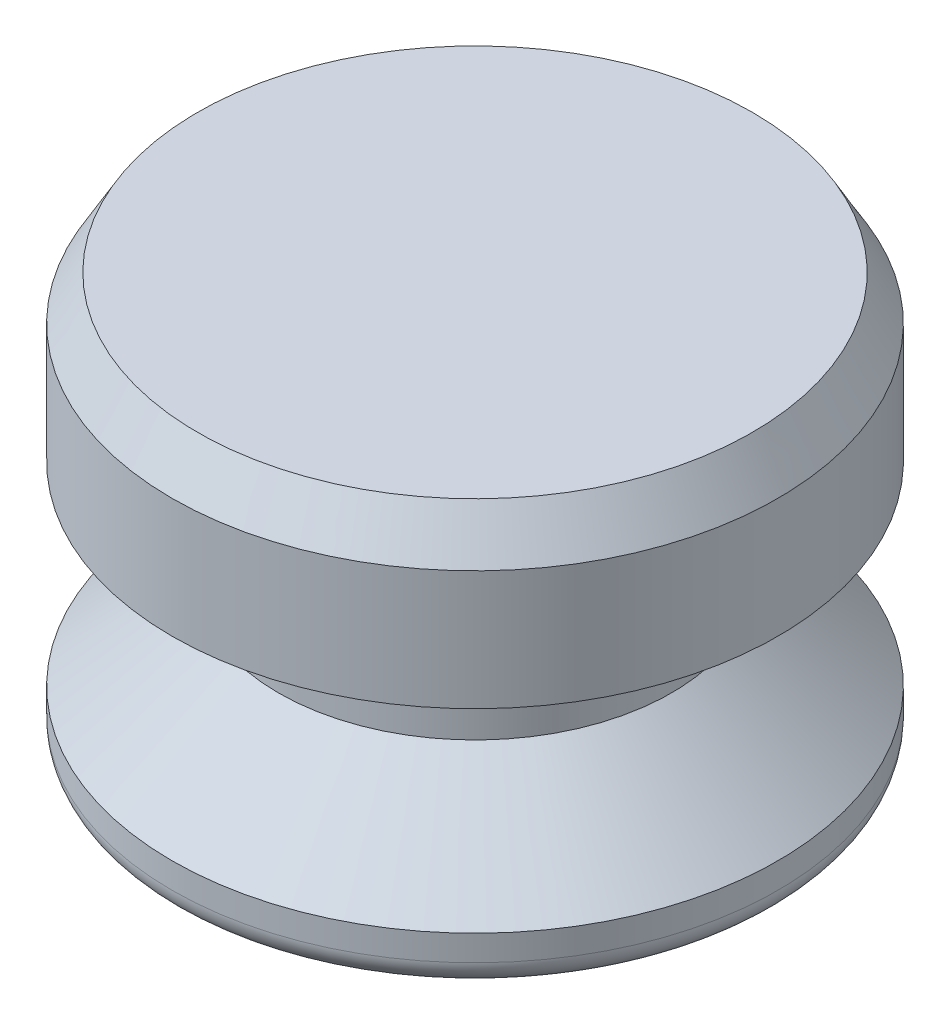
ISO-10303-21;
HEADER;
FILE_DESCRIPTION(('STEP AP214'),'2;1');
FILE_NAME('part.step','',(''),(''),'','','');
FILE_SCHEMA(('AUTOMOTIVE_DESIGN { 1 0 10303 214 1 1 1 1 }'));
ENDSEC;
DATA;
#1=APPLICATION_CONTEXT('core data for automotive mechanical design processes');
#2=APPLICATION_PROTOCOL_DEFINITION('international standard','automotive_design',2000,#1);
#3=PRODUCT_CONTEXT('',#1,'mechanical');
#4=PRODUCT('Part','Part','',(#3));
#5=PRODUCT_RELATED_PRODUCT_CATEGORY('part','',(#4));
#6=PRODUCT_DEFINITION_FORMATION('','',#4);
#7=PRODUCT_DEFINITION_CONTEXT('part definition',#1,'design');
#8=PRODUCT_DEFINITION('design','',#6,#7);
#9=PRODUCT_DEFINITION_SHAPE('','',#8);
#10=(LENGTH_UNIT() NAMED_UNIT(*) SI_UNIT(.MILLI.,.METRE.));
#11=(NAMED_UNIT(*) PLANE_ANGLE_UNIT() SI_UNIT($,.RADIAN.));
#12=(NAMED_UNIT(*) SI_UNIT($,.STERADIAN.) SOLID_ANGLE_UNIT());
#13=UNCERTAINTY_MEASURE_WITH_UNIT(LENGTH_MEASURE(1.E-05),#10,'distance_accuracy_value','');
#14=(GEOMETRIC_REPRESENTATION_CONTEXT(3) GLOBAL_UNCERTAINTY_ASSIGNED_CONTEXT((#13)) GLOBAL_UNIT_ASSIGNED_CONTEXT((#10,
#11,#12)) REPRESENTATION_CONTEXT('',''));
#15=CARTESIAN_POINT('',(0.,0.,0.));
#16=DIRECTION('',(0.,0.,1.));
#17=DIRECTION('',(1.,0.,0.));
#18=AXIS2_PLACEMENT_3D('',#15,#16,#17);
#19=CARTESIAN_POINT('',(0.,0.,0.));
#20=DIRECTION('',(0.,1.,0.));
#21=DIRECTION('',(0.,0.,1.));
#22=AXIS2_PLACEMENT_3D('',#19,#20,#21);
#23=PLANE('',#22);
#24=CARTESIAN_POINT('',(0.,0.,0.));
#25=DIRECTION('',(0.,1.,0.));
#26=DIRECTION('',(0.,0.,1.));
#27=AXIS2_PLACEMENT_3D('',#24,#25,#26);
#28=CIRCLE('',#27,8.60425);
#29=CARTESIAN_POINT('',(0.,0.,8.60425));
#30=VERTEX_POINT('',#29);
#31=EDGE_CURVE('E45',#30,#30,#28,.F.);
#32=ORIENTED_EDGE('',*,*,#31,.T.);
#33=EDGE_LOOP('',(#32));
#34=FACE_BOUND('',#33,.T.);
#35=ADVANCED_FACE('F30',(#34),#23,.F.);
#36=CARTESIAN_POINT('',(0.,0.,0.));
#37=DIRECTION('',(0.,-1.,0.));
#38=DIRECTION('',(0.,0.,-1.));
#39=AXIS2_PLACEMENT_3D('',#36,#37,#38);
#40=CYLINDRICAL_SURFACE('',#39,9.398);
#41=CARTESIAN_POINT('',(0.,0.793749999999999,0.));
#42=DIRECTION('',(0.,1.,0.));
#43=DIRECTION('',(0.,0.,1.));
#44=AXIS2_PLACEMENT_3D('',#41,#42,#43);
#45=CIRCLE('',#44,9.398);
#46=CARTESIAN_POINT('',(0.,0.793749999999999,9.398));
#47=VERTEX_POINT('',#46);
#48=EDGE_CURVE('E41',#47,#47,#45,.T.);
#49=ORIENTED_EDGE('',*,*,#48,.T.);
#50=EDGE_LOOP('',(#49));
#51=FACE_BOUND('',#50,.T.);
#52=CARTESIAN_POINT('',(0.,1.5875,0.));
#53=DIRECTION('',(0.,-1.,0.));
#54=DIRECTION('',(0.,0.,-1.));
#55=AXIS2_PLACEMENT_3D('',#52,#53,#54);
#56=CIRCLE('',#55,9.398);
#57=CARTESIAN_POINT('',(0.,1.5875,-9.398));
#58=VERTEX_POINT('',#57);
#59=EDGE_CURVE('E50',#58,#58,#56,.T.);
#60=ORIENTED_EDGE('',*,*,#59,.T.);
#61=EDGE_LOOP('',(#60));
#62=FACE_BOUND('',#61,.T.);
#63=ADVANCED_FACE('F79',(#51,#62),#40,.T.);
#64=CARTESIAN_POINT('',(0.,4.445,0.));
#65=DIRECTION('',(0.,-1.,0.));
#66=DIRECTION('',(0.,0.,-1.));
#67=AXIS2_PLACEMENT_3D('',#64,#65,#66);
#68=CONICAL_SURFACE('',#67,6.096,0.857438228784276);
#69=ORIENTED_EDGE('',*,*,#59,.F.);
#70=EDGE_LOOP('',(#69));
#71=FACE_BOUND('',#70,.T.);
#72=CARTESIAN_POINT('',(0.,4.445,0.));
#73=DIRECTION('',(0.,-1.,0.));
#74=DIRECTION('',(0.,0.,-1.));
#75=AXIS2_PLACEMENT_3D('',#72,#73,#74);
#76=CIRCLE('',#75,6.096);
#77=CARTESIAN_POINT('',(0.,4.445,-6.096));
#78=VERTEX_POINT('',#77);
#79=EDGE_CURVE('E53',#78,#78,#76,.T.);
#80=ORIENTED_EDGE('',*,*,#79,.T.);
#81=EDGE_LOOP('',(#80));
#82=FACE_BOUND('',#81,.T.);
#83=ADVANCED_FACE('F85',(#71,#82),#68,.T.);
#84=CARTESIAN_POINT('',(0.,0.,0.));
#85=DIRECTION('',(0.,-1.,0.));
#86=DIRECTION('',(0.,0.,-1.));
#87=AXIS2_PLACEMENT_3D('',#84,#85,#86);
#88=CYLINDRICAL_SURFACE('',#87,6.096);
#89=ORIENTED_EDGE('',*,*,#79,.F.);
#90=EDGE_LOOP('',(#89));
#91=FACE_BOUND('',#90,.T.);
#92=CARTESIAN_POINT('',(0.,7.62,0.));
#93=DIRECTION('',(0.,-1.,0.));
#94=DIRECTION('',(0.,0.,-1.));
#95=AXIS2_PLACEMENT_3D('',#92,#93,#94);
#96=CIRCLE('',#95,6.096);
#97=CARTESIAN_POINT('',(0.,7.62,-6.096));
#98=VERTEX_POINT('',#97);
#99=EDGE_CURVE('E56',#98,#98,#96,.T.);
#100=ORIENTED_EDGE('',*,*,#99,.T.);
#101=EDGE_LOOP('',(#100));
#102=FACE_BOUND('',#101,.T.);
#103=ADVANCED_FACE('F75',(#91,#102),#88,.T.);
#104=CARTESIAN_POINT('',(-6.096,7.62,0.));
#105=DIRECTION('',(0.,1.,0.));
#106=DIRECTION('',(0.,0.,1.));
#107=AXIS2_PLACEMENT_3D('',#104,#105,#106);
#108=PLANE('',#107);
#109=ORIENTED_EDGE('',*,*,#99,.F.);
#110=EDGE_LOOP('',(#109));
#111=FACE_BOUND('',#110,.T.);
#112=CARTESIAN_POINT('',(0.,7.62,0.));
#113=DIRECTION('',(0.,-1.,0.));
#114=DIRECTION('',(0.,0.,-1.));
#115=AXIS2_PLACEMENT_3D('',#112,#113,#114);
#116=CIRCLE('',#115,9.398);
#117=CARTESIAN_POINT('',(0.,7.62,-9.398));
#118=VERTEX_POINT('',#117);
#119=EDGE_CURVE('E59',#118,#118,#116,.T.);
#120=ORIENTED_EDGE('',*,*,#119,.T.);
#121=EDGE_LOOP('',(#120));
#122=FACE_BOUND('',#121,.T.);
#123=ADVANCED_FACE('F63',(#111,#122),#108,.F.);
#124=CARTESIAN_POINT('',(0.,0.,0.));
#125=DIRECTION('',(0.,-1.,0.));
#126=DIRECTION('',(0.,0.,-1.));
#127=AXIS2_PLACEMENT_3D('',#124,#125,#126);
#128=CYLINDRICAL_SURFACE('',#127,9.398);
#129=CARTESIAN_POINT('',(0.,11.3251846714922,0.));
#130=DIRECTION('',(0.,-1.,0.));
#131=DIRECTION('',(0.,0.,-1.));
#132=AXIS2_PLACEMENT_3D('',#129,#130,#131);
#133=CIRCLE('',#132,9.398);
#134=CARTESIAN_POINT('',(0.,11.3251846714922,-9.398));
#135=VERTEX_POINT('',#134);
#136=EDGE_CURVE('E37',#135,#135,#133,.T.);
#137=ORIENTED_EDGE('',*,*,#136,.T.);
#138=EDGE_LOOP('',(#137));
#139=FACE_BOUND('',#138,.T.);
#140=ORIENTED_EDGE('',*,*,#119,.F.);
#141=EDGE_LOOP('',(#140));
#142=FACE_BOUND('',#141,.T.);
#143=ADVANCED_FACE('F65',(#139,#142),#128,.T.);
#144=CARTESIAN_POINT('',(-9.398,12.7,0.));
#145=DIRECTION('',(0.,-1.,0.));
#146=DIRECTION('',(0.,0.,-1.));
#147=AXIS2_PLACEMENT_3D('',#144,#145,#146);
#148=PLANE('',#147);
#149=CARTESIAN_POINT('',(0.,12.7,0.));
#150=DIRECTION('',(0.,-1.,0.));
#151=DIRECTION('',(0.,0.,-1.));
#152=AXIS2_PLACEMENT_3D('',#149,#150,#151);
#153=CIRCLE('',#152,8.60424999999999);
#154=CARTESIAN_POINT('',(0.,12.7,-8.60424999999999));
#155=VERTEX_POINT('',#154);
#156=EDGE_CURVE('E10',#155,#155,#153,.F.);
#157=ORIENTED_EDGE('',*,*,#156,.T.);
#158=EDGE_LOOP('',(#157));
#159=FACE_BOUND('',#158,.T.);
#160=ADVANCED_FACE('F67',(#159),#148,.F.);
#161=CARTESIAN_POINT('',(0.,0.793749999999999,0.));
#162=DIRECTION('',(0.,1.,0.));
#163=DIRECTION('',(0.,0.,1.));
#164=AXIS2_PLACEMENT_3D('',#161,#162,#163);
#165=TOROIDAL_SURFACE('',#164,8.60425,0.79375);
#166=ORIENTED_EDGE('',*,*,#48,.F.);
#167=EDGE_LOOP('',(#166));
#168=FACE_BOUND('',#167,.T.);
#169=ORIENTED_EDGE('',*,*,#31,.F.);
#170=EDGE_LOOP('',(#169));
#171=FACE_BOUND('',#170,.T.);
#172=ADVANCED_FACE('F73',(#168,#171),#165,.T.);
#173=CARTESIAN_POINT('',(0.,11.3251846714922,0.));
#174=DIRECTION('',(0.,-1.,0.));
#175=DIRECTION('',(0.,0.,-1.));
#176=AXIS2_PLACEMENT_3D('',#173,#174,#175);
#177=CONICAL_SURFACE('',#176,9.398,0.5235987755983);
#178=ORIENTED_EDGE('',*,*,#156,.F.);
#179=EDGE_LOOP('',(#178));
#180=FACE_BOUND('',#179,.T.);
#181=ORIENTED_EDGE('',*,*,#136,.F.);
#182=EDGE_LOOP('',(#181));
#183=FACE_BOUND('',#182,.T.);
#184=ADVANCED_FACE('F32',(#180,#183),#177,.T.);
#185=CLOSED_SHELL('',(#35,#63,#83,#103,#123,#143,#160,#172,#184));
#186=MANIFOLD_SOLID_BREP('B2',#185);
#187=ADVANCED_BREP_SHAPE_REPRESENTATION('',(#18,#186),#14);
#188=SHAPE_DEFINITION_REPRESENTATION(#9,#187);
ENDSEC;
END-ISO-10303-21;
